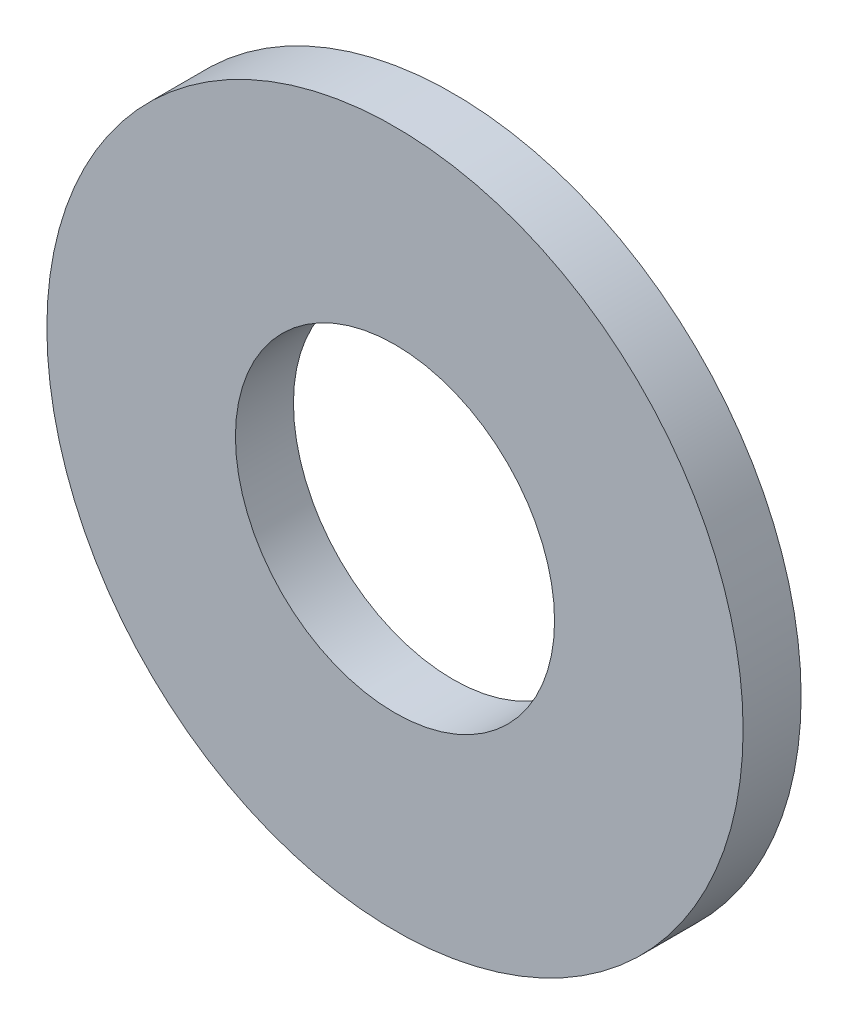
ISO-10303-21;
HEADER;
FILE_DESCRIPTION(('STEP AP214'),'2;1');
FILE_NAME('part.step','',(''),(''),'','','');
FILE_SCHEMA(('AUTOMOTIVE_DESIGN { 1 0 10303 214 1 1 1 1 }'));
ENDSEC;
DATA;
#1=APPLICATION_CONTEXT('core data for automotive mechanical design processes');
#2=APPLICATION_PROTOCOL_DEFINITION('international standard','automotive_design',2000,#1);
#3=PRODUCT_CONTEXT('',#1,'mechanical');
#4=PRODUCT('Part','Part','',(#3));
#5=PRODUCT_RELATED_PRODUCT_CATEGORY('part','',(#4));
#6=PRODUCT_DEFINITION_FORMATION('','',#4);
#7=PRODUCT_DEFINITION_CONTEXT('part definition',#1,'design');
#8=PRODUCT_DEFINITION('design','',#6,#7);
#9=PRODUCT_DEFINITION_SHAPE('','',#8);
#10=(LENGTH_UNIT() NAMED_UNIT(*) SI_UNIT(.MILLI.,.METRE.));
#11=(NAMED_UNIT(*) PLANE_ANGLE_UNIT() SI_UNIT($,.RADIAN.));
#12=(NAMED_UNIT(*) SI_UNIT($,.STERADIAN.) SOLID_ANGLE_UNIT());
#13=UNCERTAINTY_MEASURE_WITH_UNIT(LENGTH_MEASURE(1.E-05),#10,'distance_accuracy_value','');
#14=(GEOMETRIC_REPRESENTATION_CONTEXT(3) GLOBAL_UNCERTAINTY_ASSIGNED_CONTEXT((#13)) GLOBAL_UNIT_ASSIGNED_CONTEXT((#10,
#11,#12)) REPRESENTATION_CONTEXT('',''));
#15=CARTESIAN_POINT('',(0.,0.,0.));
#16=DIRECTION('',(0.,0.,1.));
#17=DIRECTION('',(1.,0.,0.));
#18=AXIS2_PLACEMENT_3D('',#15,#16,#17);
#19=CARTESIAN_POINT('',(0.,0.,1.));
#20=DIRECTION('',(0.,0.,1.));
#21=DIRECTION('',(1.,0.,0.));
#22=AXIS2_PLACEMENT_3D('',#19,#20,#21);
#23=PLANE('',#22);
#24=CARTESIAN_POINT('',(0.,0.,1.));
#25=DIRECTION('',(0.,0.,1.));
#26=DIRECTION('',(1.,0.,0.));
#27=AXIS2_PLACEMENT_3D('',#24,#25,#26);
#28=CIRCLE('',#27,6.);
#29=CARTESIAN_POINT('',(6.,0.,1.));
#30=VERTEX_POINT('',#29);
#31=EDGE_CURVE('E10',#30,#30,#28,.T.);
#32=ORIENTED_EDGE('',*,*,#31,.T.);
#33=EDGE_LOOP('',(#32));
#34=FACE_BOUND('',#33,.T.);
#35=CARTESIAN_POINT('',(0.,0.,1.));
#36=DIRECTION('',(0.,0.,1.));
#37=DIRECTION('',(1.,0.,0.));
#38=AXIS2_PLACEMENT_3D('',#35,#36,#37);
#39=CIRCLE('',#38,2.75);
#40=CARTESIAN_POINT('',(2.75,0.,1.));
#41=VERTEX_POINT('',#40);
#42=EDGE_CURVE('E41',#41,#41,#39,.T.);
#43=ORIENTED_EDGE('',*,*,#42,.F.);
#44=EDGE_LOOP('',(#43));
#45=FACE_BOUND('',#44,.T.);
#46=ADVANCED_FACE('F30',(#34,#45),#23,.T.);
#47=CARTESIAN_POINT('',(0.,0.,0.));
#48=DIRECTION('',(0.,0.,1.));
#49=DIRECTION('',(1.,0.,0.));
#50=AXIS2_PLACEMENT_3D('',#47,#48,#49);
#51=PLANE('',#50);
#52=CARTESIAN_POINT('',(0.,0.,0.));
#53=DIRECTION('',(0.,0.,1.));
#54=DIRECTION('',(1.,0.,0.));
#55=AXIS2_PLACEMENT_3D('',#52,#53,#54);
#56=CIRCLE('',#55,6.);
#57=CARTESIAN_POINT('',(6.,0.,0.));
#58=VERTEX_POINT('',#57);
#59=EDGE_CURVE('E34',#58,#58,#56,.T.);
#60=ORIENTED_EDGE('',*,*,#59,.F.);
#61=EDGE_LOOP('',(#60));
#62=FACE_BOUND('',#61,.T.);
#63=CARTESIAN_POINT('',(0.,0.,0.));
#64=DIRECTION('',(0.,0.,1.));
#65=DIRECTION('',(1.,0.,0.));
#66=AXIS2_PLACEMENT_3D('',#63,#64,#65);
#67=CIRCLE('',#66,2.75);
#68=CARTESIAN_POINT('',(2.75,0.,0.));
#69=VERTEX_POINT('',#68);
#70=EDGE_CURVE('E43',#69,#69,#67,.T.);
#71=ORIENTED_EDGE('',*,*,#70,.T.);
#72=EDGE_LOOP('',(#71));
#73=FACE_BOUND('',#72,.T.);
#74=ADVANCED_FACE('F53',(#62,#73),#51,.F.);
#75=CARTESIAN_POINT('',(0.,0.,1.));
#76=DIRECTION('',(0.,0.,-1.));
#77=DIRECTION('',(-1.,0.,0.));
#78=AXIS2_PLACEMENT_3D('',#75,#76,#77);
#79=CYLINDRICAL_SURFACE('',#78,6.);
#80=ORIENTED_EDGE('',*,*,#31,.F.);
#81=EDGE_LOOP('',(#80));
#82=FACE_BOUND('',#81,.T.);
#83=ORIENTED_EDGE('',*,*,#59,.T.);
#84=EDGE_LOOP('',(#83));
#85=FACE_BOUND('',#84,.T.);
#86=ADVANCED_FACE('F32',(#82,#85),#79,.T.);
#87=CARTESIAN_POINT('',(0.,0.,1.));
#88=DIRECTION('',(0.,0.,-1.));
#89=DIRECTION('',(-1.,0.,0.));
#90=AXIS2_PLACEMENT_3D('',#87,#88,#89);
#91=CYLINDRICAL_SURFACE('',#90,2.75);
#92=ORIENTED_EDGE('',*,*,#42,.T.);
#93=EDGE_LOOP('',(#92));
#94=FACE_BOUND('',#93,.T.);
#95=ORIENTED_EDGE('',*,*,#70,.F.);
#96=EDGE_LOOP('',(#95));
#97=FACE_BOUND('',#96,.T.);
#98=ADVANCED_FACE('F49',(#94,#97),#91,.F.);
#99=CLOSED_SHELL('',(#46,#74,#86,#98));
#100=MANIFOLD_SOLID_BREP('B2',#99);
#101=ADVANCED_BREP_SHAPE_REPRESENTATION('',(#18,#100),#14);
#102=SHAPE_DEFINITION_REPRESENTATION(#9,#101);
ENDSEC;
END-ISO-10303-21;
